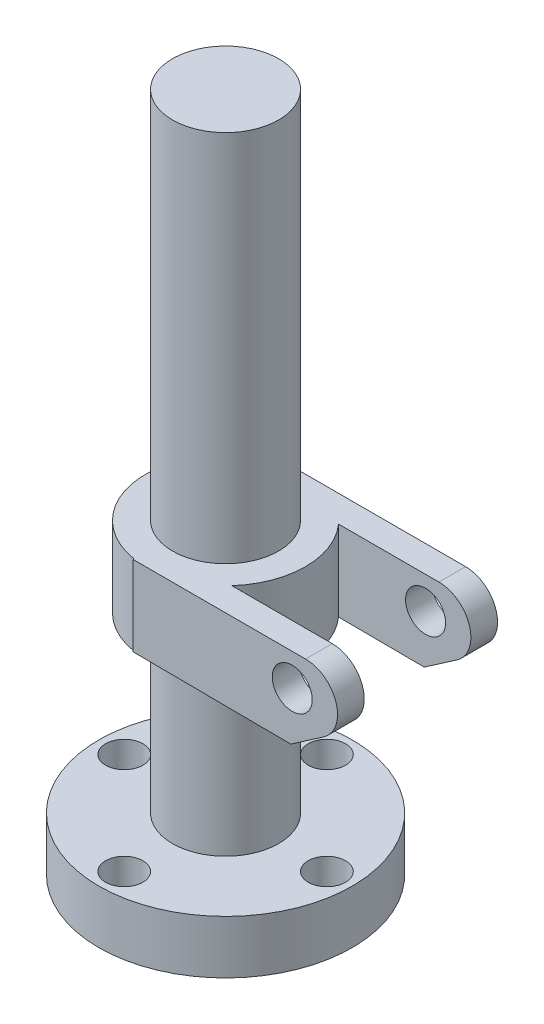
ISO-10303-21;
HEADER;
FILE_DESCRIPTION(('STEP AP214'),'2;1');
FILE_NAME('part.step','',(''),(''),'','','');
FILE_SCHEMA(('AUTOMOTIVE_DESIGN { 1 0 10303 214 1 1 1 1 }'));
ENDSEC;
DATA;
#1=APPLICATION_CONTEXT('core data for automotive mechanical design processes');
#2=APPLICATION_PROTOCOL_DEFINITION('international standard','automotive_design',2000,#1);
#3=PRODUCT_CONTEXT('',#1,'mechanical');
#4=PRODUCT('Part','Part','',(#3));
#5=PRODUCT_RELATED_PRODUCT_CATEGORY('part','',(#4));
#6=PRODUCT_DEFINITION_FORMATION('','',#4);
#7=PRODUCT_DEFINITION_CONTEXT('part definition',#1,'design');
#8=PRODUCT_DEFINITION('design','',#6,#7);
#9=PRODUCT_DEFINITION_SHAPE('','',#8);
#10=(LENGTH_UNIT() NAMED_UNIT(*) SI_UNIT(.MILLI.,.METRE.));
#11=(NAMED_UNIT(*) PLANE_ANGLE_UNIT() SI_UNIT($,.RADIAN.));
#12=(NAMED_UNIT(*) SI_UNIT($,.STERADIAN.) SOLID_ANGLE_UNIT());
#13=UNCERTAINTY_MEASURE_WITH_UNIT(LENGTH_MEASURE(1.E-05),#10,'distance_accuracy_value','');
#14=(GEOMETRIC_REPRESENTATION_CONTEXT(3) GLOBAL_UNCERTAINTY_ASSIGNED_CONTEXT((#13)) GLOBAL_UNIT_ASSIGNED_CONTEXT((#10,
#11,#12)) REPRESENTATION_CONTEXT('',''));
#15=CARTESIAN_POINT('',(0.,0.,0.));
#16=DIRECTION('',(0.,0.,1.));
#17=DIRECTION('',(1.,0.,0.));
#18=AXIS2_PLACEMENT_3D('',#15,#16,#17);
#19=CARTESIAN_POINT('',(0.,115.,0.));
#20=DIRECTION('',(0.,1.,0.));
#21=DIRECTION('',(0.,0.,1.));
#22=AXIS2_PLACEMENT_3D('',#19,#20,#21);
#23=PLANE('',#22);
#24=CARTESIAN_POINT('',(0.,115.,0.));
#25=DIRECTION('',(0.,1.,0.));
#26=DIRECTION('',(0.,0.,1.));
#27=AXIS2_PLACEMENT_3D('',#24,#25,#26);
#28=CIRCLE('',#27,19.9);
#29=CARTESIAN_POINT('',(0.,115.,19.9));
#30=VERTEX_POINT('',#29);
#31=EDGE_CURVE('E261',#30,#30,#28,.T.);
#32=ORIENTED_EDGE('',*,*,#31,.F.);
#33=EDGE_LOOP('',(#32));
#34=FACE_BOUND('',#33,.T.);
#35=DIRECTION('',(-1.,0.,0.));
#36=VECTOR('',#35,1.);
#37=CARTESIAN_POINT('',(22.3606797749979,115.,-20.));
#38=LINE('',#37,#36);
#39=CARTESIAN_POINT('',(60.,115.,-20.));
#40=VERTEX_POINT('',#39);
#41=CARTESIAN_POINT('',(22.3606797749979,115.,-20.));
#42=VERTEX_POINT('',#41);
#43=EDGE_CURVE('E154',#40,#42,#38,.T.);
#44=ORIENTED_EDGE('',*,*,#43,.F.);
#45=DIRECTION('',(0.,0.,1.));
#46=VECTOR('',#45,1.);
#47=CARTESIAN_POINT('',(60.,115.,-30.));
#48=LINE('',#47,#46);
#49=CARTESIAN_POINT('',(60.,115.,-30.));
#50=VERTEX_POINT('',#49);
#51=EDGE_CURVE('E227',#50,#40,#48,.T.);
#52=ORIENTED_EDGE('',*,*,#51,.F.);
#53=DIRECTION('',(-1.,0.,0.));
#54=VECTOR('',#53,1.);
#55=CARTESIAN_POINT('',(-4.68489562855849,115.,-30.));
#56=LINE('',#55,#54);
#57=CARTESIAN_POINT('',(-4.68489562855849,115.,-30.));
#58=VERTEX_POINT('',#57);
#59=EDGE_CURVE('E218',#50,#58,#56,.T.);
#60=ORIENTED_EDGE('',*,*,#59,.T.);
#61=DIRECTION('',(0.,0.,1.));
#62=VECTOR('',#61,1.);
#63=CARTESIAN_POINT('',(-4.68489562855849,115.,-30.));
#64=LINE('',#63,#62);
#65=CARTESIAN_POINT('',(-4.68489562855849,115.,-29.6319380559138));
#66=VERTEX_POINT('',#65);
#67=EDGE_CURVE('E221',#58,#66,#64,.T.);
#68=ORIENTED_EDGE('',*,*,#67,.T.);
#69=CARTESIAN_POINT('',(0.,115.,0.));
#70=DIRECTION('',(0.,1.,0.));
#71=DIRECTION('',(0.,0.,1.));
#72=AXIS2_PLACEMENT_3D('',#69,#70,#71);
#73=CIRCLE('',#72,30.);
#74=CARTESIAN_POINT('',(-4.68489562855849,115.,29.6319380559138));
#75=VERTEX_POINT('',#74);
#76=EDGE_CURVE('E267',#66,#75,#73,.T.);
#77=ORIENTED_EDGE('',*,*,#76,.T.);
#78=CARTESIAN_POINT('',(-4.68489562855849,115.,30.));
#79=VERTEX_POINT('',#78);
#80=EDGE_CURVE('E226',#75,#79,#64,.T.);
#81=ORIENTED_EDGE('',*,*,#80,.T.);
#82=DIRECTION('',(-1.,0.,0.));
#83=VECTOR('',#82,1.);
#84=CARTESIAN_POINT('',(-4.68489562855849,115.,30.));
#85=LINE('',#84,#83);
#86=CARTESIAN_POINT('',(60.,115.,30.));
#87=VERTEX_POINT('',#86);
#88=EDGE_CURVE('E199',#87,#79,#85,.T.);
#89=ORIENTED_EDGE('',*,*,#88,.F.);
#90=CARTESIAN_POINT('',(60.,115.,20.));
#91=VERTEX_POINT('',#90);
#92=EDGE_CURVE('E230',#91,#87,#48,.T.);
#93=ORIENTED_EDGE('',*,*,#92,.F.);
#94=DIRECTION('',(1.,0.,0.));
#95=VECTOR('',#94,1.);
#96=CARTESIAN_POINT('',(85.6131812639909,115.,20.));
#97=LINE('',#96,#95);
#98=CARTESIAN_POINT('',(22.3606797749979,115.,20.));
#99=VERTEX_POINT('',#98);
#100=EDGE_CURVE('E151',#99,#91,#97,.T.);
#101=ORIENTED_EDGE('',*,*,#100,.F.);
#102=CARTESIAN_POINT('',(0.,115.,0.));
#103=DIRECTION('',(0.,-1.,0.));
#104=DIRECTION('',(0.,0.,1.));
#105=AXIS2_PLACEMENT_3D('',#102,#103,#104);
#106=CIRCLE('',#105,30.);
#107=EDGE_CURVE('E144',#42,#99,#106,.T.);
#108=ORIENTED_EDGE('',*,*,#107,.F.);
#109=EDGE_LOOP('',(#44,#52,#60,#68,#77,#81,#89,#93,#101,#108));
#110=FACE_BOUND('',#109,.T.);
#111=ADVANCED_FACE('F43',(#34,#110),#23,.T.);
#112=CARTESIAN_POINT('',(54.4855596327094,84.6062896950359,-30.));
#113=DIRECTION('',(-0.00665368532404855,-0.999977863990803,0.));
#114=DIRECTION('',(0.999977863990803,-0.00665368532404855,0.));
#115=AXIS2_PLACEMENT_3D('',#112,#113,#114);
#116=PLANE('',#115);
#117=DIRECTION('',(0.999977863990803,-0.00665368532404855,0.));
#118=VECTOR('',#117,1.);
#119=CARTESIAN_POINT('',(54.4855596327094,84.6062896950359,-20.));
#120=LINE('',#119,#118);
#121=CARTESIAN_POINT('',(22.3606797749979,84.8200432683331,-20.));
#122=VERTEX_POINT('',#121);
#123=CARTESIAN_POINT('',(54.4855596327094,84.6062896950359,-20.));
#124=VERTEX_POINT('',#123);
#125=EDGE_CURVE('E180',#122,#124,#120,.T.);
#126=ORIENTED_EDGE('',*,*,#125,.F.);
#127=CARTESIAN_POINT('',(0.,84.9688274886766,0.));
#128=DIRECTION('',(-0.00665368532404855,-0.999977863990803,0.));
#129=DIRECTION('',(-0.999977863990803,0.00665368532404855,0.));
#130=AXIS2_PLACEMENT_3D('',#127,#128,#129);
#131=ELLIPSE('',#130,30.0006640949763,30.);
#132=CARTESIAN_POINT('',(22.3606797749979,84.8200432683331,20.));
#133=VERTEX_POINT('',#132);
#134=EDGE_CURVE('E11',#133,#122,#131,.F.);
#135=ORIENTED_EDGE('',*,*,#134,.F.);
#136=DIRECTION('',(-0.999977863990803,0.00665368532404855,0.));
#137=VECTOR('',#136,1.);
#138=CARTESIAN_POINT('',(54.4855596327094,84.6062896950359,20.));
#139=LINE('',#138,#137);
#140=CARTESIAN_POINT('',(54.4855596327094,84.6062896950359,20.));
#141=VERTEX_POINT('',#140);
#142=EDGE_CURVE('E175',#141,#133,#139,.T.);
#143=ORIENTED_EDGE('',*,*,#142,.F.);
#144=DIRECTION('',(0.,0.,1.));
#145=VECTOR('',#144,1.);
#146=CARTESIAN_POINT('',(54.4855596327094,84.6062896950359,-30.));
#147=LINE('',#146,#145);
#148=CARTESIAN_POINT('',(54.4855596327094,84.6062896950359,30.));
#149=VERTEX_POINT('',#148);
#150=EDGE_CURVE('E240',#141,#149,#147,.T.);
#151=ORIENTED_EDGE('',*,*,#150,.T.);
#152=DIRECTION('',(0.999977863990803,-0.00665368532404855,0.));
#153=VECTOR('',#152,1.);
#154=CARTESIAN_POINT('',(54.4855596327094,84.6062896950359,30.));
#155=LINE('',#154,#153);
#156=CARTESIAN_POINT('',(-4.68489562855849,85.,30.));
#157=VERTEX_POINT('',#156);
#158=EDGE_CURVE('E187',#157,#149,#155,.T.);
#159=ORIENTED_EDGE('',*,*,#158,.F.);
#160=DIRECTION('',(0.,0.,1.));
#161=VECTOR('',#160,1.);
#162=CARTESIAN_POINT('',(-4.68489562855849,85.,-30.));
#163=LINE('',#162,#161);
#164=CARTESIAN_POINT('',(-4.68489562855848,85.,29.6319380559138));
#165=VERTEX_POINT('',#164);
#166=EDGE_CURVE('E68',#165,#157,#163,.T.);
#167=ORIENTED_EDGE('',*,*,#166,.F.);
#168=DIRECTION('',(0.,0.,1.));
#169=VECTOR('',#168,1.);
#170=CARTESIAN_POINT('',(-4.68489562855849,85.,0.));
#171=LINE('',#170,#169);
#172=CARTESIAN_POINT('',(-4.68489562855849,85.,19.3406761244149));
#173=VERTEX_POINT('',#172);
#174=EDGE_CURVE('E265',#173,#165,#171,.T.);
#175=ORIENTED_EDGE('',*,*,#174,.F.);
#176=CARTESIAN_POINT('',(0.,84.9688274886766,0.));
#177=DIRECTION('',(-0.00665368532404855,-0.999977863990803,0.));
#178=DIRECTION('',(0.999977863990803,-0.00665368532404855,0.));
#179=AXIS2_PLACEMENT_3D('',#176,#177,#178);
#180=ELLIPSE('',#179,19.9004405163343,19.9);
#181=CARTESIAN_POINT('',(-4.68489562855849,85.,-19.3406761244149));
#182=VERTEX_POINT('',#181);
#183=EDGE_CURVE('E225',#182,#173,#180,.T.);
#184=ORIENTED_EDGE('',*,*,#183,.F.);
#185=CARTESIAN_POINT('',(-4.68489562855849,85.,-29.6319380559138));
#186=VERTEX_POINT('',#185);
#187=EDGE_CURVE('E292',#186,#182,#171,.T.);
#188=ORIENTED_EDGE('',*,*,#187,.F.);
#189=CARTESIAN_POINT('',(-4.68489562855849,85.,-30.));
#190=VERTEX_POINT('',#189);
#191=EDGE_CURVE('E241',#190,#186,#163,.T.);
#192=ORIENTED_EDGE('',*,*,#191,.F.);
#193=DIRECTION('',(0.999977863990803,-0.00665368532404855,0.));
#194=VECTOR('',#193,1.);
#195=CARTESIAN_POINT('',(54.4855596327094,84.6062896950359,-30.));
#196=LINE('',#195,#194);
#197=CARTESIAN_POINT('',(54.4855596327094,84.6062896950359,-30.));
#198=VERTEX_POINT('',#197);
#199=EDGE_CURVE('E206',#190,#198,#196,.T.);
#200=ORIENTED_EDGE('',*,*,#199,.T.);
#201=EDGE_CURVE('E236',#198,#124,#147,.T.);
#202=ORIENTED_EDGE('',*,*,#201,.T.);
#203=EDGE_LOOP('',(#126,#135,#143,#151,#159,#167,#175,#184,#188,#192,#200,#202));
#204=FACE_BOUND('',#203,.T.);
#205=ADVANCED_FACE('F308',(#204),#116,.T.);
#206=CARTESIAN_POINT('',(60.,103.,-30.));
#207=DIRECTION('',(0.,0.,1.));
#208=DIRECTION('',(1.,0.,0.));
#209=AXIS2_PLACEMENT_3D('',#206,#207,#208);
#210=CYLINDRICAL_SURFACE('',#209,12.);
#211=CARTESIAN_POINT('',(60.,103.,-20.));
#212=DIRECTION('',(0.,0.,-1.));
#213=DIRECTION('',(-1.,0.,0.));
#214=AXIS2_PLACEMENT_3D('',#211,#212,#213);
#215=CIRCLE('',#214,12.);
#216=CARTESIAN_POINT('',(66.8201813211914,93.126544336147,-20.));
#217=VERTEX_POINT('',#216);
#218=EDGE_CURVE('E157',#217,#40,#215,.F.);
#219=ORIENTED_EDGE('',*,*,#218,.F.);
#220=DIRECTION('',(0.,0.,1.));
#221=VECTOR('',#220,1.);
#222=CARTESIAN_POINT('',(66.8201813211914,93.126544336147,-30.));
#223=LINE('',#222,#221);
#224=CARTESIAN_POINT('',(66.8201813211914,93.126544336147,-30.));
#225=VERTEX_POINT('',#224);
#226=EDGE_CURVE('E231',#225,#217,#223,.T.);
#227=ORIENTED_EDGE('',*,*,#226,.F.);
#228=CARTESIAN_POINT('',(60.,103.,-30.));
#229=DIRECTION('',(0.,0.,1.));
#230=DIRECTION('',(1.,0.,0.));
#231=AXIS2_PLACEMENT_3D('',#228,#229,#230);
#232=CIRCLE('',#231,12.);
#233=EDGE_CURVE('E214',#225,#50,#232,.T.);
#234=ORIENTED_EDGE('',*,*,#233,.T.);
#235=ORIENTED_EDGE('',*,*,#51,.T.);
#236=EDGE_LOOP('',(#219,#227,#234,#235));
#237=FACE_BOUND('',#236,.T.);
#238=ADVANCED_FACE('F300',(#237),#210,.T.);
#239=CARTESIAN_POINT('',(66.8201813211914,93.126544336147,-30.));
#240=DIRECTION('',(0.56834844343262,-0.822787971987752,0.));
#241=DIRECTION('',(0.822787971987752,0.56834844343262,0.));
#242=AXIS2_PLACEMENT_3D('',#239,#240,#241);
#243=PLANE('',#242);
#244=DIRECTION('',(0.822787971987752,0.56834844343262,0.));
#245=VECTOR('',#244,1.);
#246=CARTESIAN_POINT('',(66.8201813211914,93.126544336147,-20.));
#247=LINE('',#246,#245);
#248=EDGE_CURVE('E53',#124,#217,#247,.T.);
#249=ORIENTED_EDGE('',*,*,#248,.F.);
#250=ORIENTED_EDGE('',*,*,#201,.F.);
#251=DIRECTION('',(0.822787971987752,0.56834844343262,0.));
#252=VECTOR('',#251,1.);
#253=CARTESIAN_POINT('',(66.8201813211914,93.126544336147,-30.));
#254=LINE('',#253,#252);
#255=EDGE_CURVE('E210',#198,#225,#254,.T.);
#256=ORIENTED_EDGE('',*,*,#255,.T.);
#257=ORIENTED_EDGE('',*,*,#226,.T.);
#258=EDGE_LOOP('',(#249,#250,#256,#257));
#259=FACE_BOUND('',#258,.T.);
#260=ADVANCED_FACE('F302',(#259),#243,.T.);
#261=CARTESIAN_POINT('',(0.,20.,0.));
#262=DIRECTION('',(0.,-1.,0.));
#263=DIRECTION('',(0.,0.,-1.));
#264=AXIS2_PLACEMENT_3D('',#261,#262,#263);
#265=CYLINDRICAL_SURFACE('',#264,47.5);
#266=CARTESIAN_POINT('',(0.,20.,0.));
#267=DIRECTION('',(0.,1.,0.));
#268=DIRECTION('',(0.,0.,1.));
#269=AXIS2_PLACEMENT_3D('',#266,#267,#268);
#270=CIRCLE('',#269,47.5);
#271=CARTESIAN_POINT('',(0.,20.,47.5));
#272=VERTEX_POINT('',#271);
#273=EDGE_CURVE('E282',#272,#272,#270,.T.);
#274=ORIENTED_EDGE('',*,*,#273,.F.);
#275=EDGE_LOOP('',(#274));
#276=FACE_BOUND('',#275,.T.);
#277=CARTESIAN_POINT('',(0.,0.,0.));
#278=DIRECTION('',(0.,1.,0.));
#279=DIRECTION('',(0.,0.,1.));
#280=AXIS2_PLACEMENT_3D('',#277,#278,#279);
#281=CIRCLE('',#280,47.5);
#282=CARTESIAN_POINT('',(0.,0.,47.5));
#283=VERTEX_POINT('',#282);
#284=EDGE_CURVE('E278',#283,#283,#281,.T.);
#285=ORIENTED_EDGE('',*,*,#284,.T.);
#286=EDGE_LOOP('',(#285));
#287=FACE_BOUND('',#286,.T.);
#288=ADVANCED_FACE('F45',(#276,#287),#265,.T.);
#289=CARTESIAN_POINT('',(0.,20.,0.));
#290=DIRECTION('',(0.,1.,0.));
#291=DIRECTION('',(0.,0.,1.));
#292=AXIS2_PLACEMENT_3D('',#289,#290,#291);
#293=PLANE('',#292);
#294=CARTESIAN_POINT('',(38.,20.,-3.98028872628117E-13));
#295=DIRECTION('',(0.,1.,0.));
#296=DIRECTION('',(0.,0.,1.));
#297=AXIS2_PLACEMENT_3D('',#294,#295,#296);
#298=CIRCLE('',#297,7.);
#299=CARTESIAN_POINT('',(38.,20.,6.9999999999996));
#300=VERTEX_POINT('',#299);
#301=EDGE_CURVE('E760',#300,#300,#298,.T.);
#302=ORIENTED_EDGE('',*,*,#301,.F.);
#303=EDGE_LOOP('',(#302));
#304=FACE_BOUND('',#303,.T.);
#305=CARTESIAN_POINT('',(0.,20.,38.));
#306=DIRECTION('',(0.,1.,0.));
#307=DIRECTION('',(0.,0.,1.));
#308=AXIS2_PLACEMENT_3D('',#305,#306,#307);
#309=CIRCLE('',#308,7.);
#310=CARTESIAN_POINT('',(0.,20.,45.));
#311=VERTEX_POINT('',#310);
#312=EDGE_CURVE('E773',#311,#311,#309,.T.);
#313=ORIENTED_EDGE('',*,*,#312,.F.);
#314=EDGE_LOOP('',(#313));
#315=FACE_BOUND('',#314,.T.);
#316=CARTESIAN_POINT('',(-38.,20.,1.32676290876039E-13));
#317=DIRECTION('',(0.,1.,0.));
#318=DIRECTION('',(0.,0.,1.));
#319=AXIS2_PLACEMENT_3D('',#316,#317,#318);
#320=CIRCLE('',#319,7.);
#321=CARTESIAN_POINT('',(-38.,20.,7.00000000000013));
#322=VERTEX_POINT('',#321);
#323=EDGE_CURVE('E789',#322,#322,#320,.T.);
#324=ORIENTED_EDGE('',*,*,#323,.F.);
#325=EDGE_LOOP('',(#324));
#326=FACE_BOUND('',#325,.T.);
#327=CARTESIAN_POINT('',(0.,20.,-38.));
#328=DIRECTION('',(0.,1.,0.));
#329=DIRECTION('',(0.,0.,1.));
#330=AXIS2_PLACEMENT_3D('',#327,#328,#329);
#331=CIRCLE('',#330,7.);
#332=CARTESIAN_POINT('',(0.,20.,-31.));
#333=VERTEX_POINT('',#332);
#334=EDGE_CURVE('E805',#333,#333,#331,.T.);
#335=ORIENTED_EDGE('',*,*,#334,.F.);
#336=EDGE_LOOP('',(#335));
#337=FACE_BOUND('',#336,.T.);
#338=CARTESIAN_POINT('',(0.,20.,0.));
#339=DIRECTION('',(0.,1.,0.));
#340=DIRECTION('',(0.,0.,1.));
#341=AXIS2_PLACEMENT_3D('',#338,#339,#340);
#342=CIRCLE('',#341,19.9);
#343=CARTESIAN_POINT('',(0.,20.,19.9));
#344=VERTEX_POINT('',#343);
#345=EDGE_CURVE('E266',#344,#344,#342,.T.);
#346=ORIENTED_EDGE('',*,*,#345,.F.);
#347=EDGE_LOOP('',(#346));
#348=FACE_BOUND('',#347,.T.);
#349=ORIENTED_EDGE('',*,*,#273,.T.);
#350=EDGE_LOOP('',(#349));
#351=FACE_BOUND('',#350,.T.);
#352=ADVANCED_FACE('F328',(#304,#315,#326,#337,#348,#351),#293,.T.);
#353=CARTESIAN_POINT('',(0.,0.,0.));
#354=DIRECTION('',(0.,1.,0.));
#355=DIRECTION('',(0.,0.,1.));
#356=AXIS2_PLACEMENT_3D('',#353,#354,#355);
#357=PLANE('',#356);
#358=CARTESIAN_POINT('',(38.,0.,-3.98028872628117E-13));
#359=DIRECTION('',(0.,1.,0.));
#360=DIRECTION('',(0.,0.,1.));
#361=AXIS2_PLACEMENT_3D('',#358,#359,#360);
#362=CIRCLE('',#361,5.);
#363=CARTESIAN_POINT('',(38.,0.,4.9999999999996));
#364=VERTEX_POINT('',#363);
#365=EDGE_CURVE('E770',#364,#364,#362,.T.);
#366=ORIENTED_EDGE('',*,*,#365,.T.);
#367=EDGE_LOOP('',(#366));
#368=FACE_BOUND('',#367,.T.);
#369=CARTESIAN_POINT('',(0.,0.,38.));
#370=DIRECTION('',(0.,1.,0.));
#371=DIRECTION('',(0.,0.,1.));
#372=AXIS2_PLACEMENT_3D('',#369,#370,#371);
#373=CIRCLE('',#372,4.99999999999999);
#374=CARTESIAN_POINT('',(0.,0.,43.));
#375=VERTEX_POINT('',#374);
#376=EDGE_CURVE('E785',#375,#375,#373,.T.);
#377=ORIENTED_EDGE('',*,*,#376,.T.);
#378=EDGE_LOOP('',(#377));
#379=FACE_BOUND('',#378,.T.);
#380=CARTESIAN_POINT('',(-38.,0.,1.32676290876039E-13));
#381=DIRECTION('',(0.,1.,0.));
#382=DIRECTION('',(0.,0.,1.));
#383=AXIS2_PLACEMENT_3D('',#380,#381,#382);
#384=CIRCLE('',#383,5.);
#385=CARTESIAN_POINT('',(-38.,0.,5.00000000000013));
#386=VERTEX_POINT('',#385);
#387=EDGE_CURVE('E801',#386,#386,#384,.T.);
#388=ORIENTED_EDGE('',*,*,#387,.T.);
#389=EDGE_LOOP('',(#388));
#390=FACE_BOUND('',#389,.T.);
#391=CARTESIAN_POINT('',(0.,0.,-38.));
#392=DIRECTION('',(0.,1.,0.));
#393=DIRECTION('',(0.,0.,1.));
#394=AXIS2_PLACEMENT_3D('',#391,#392,#393);
#395=CIRCLE('',#394,4.99999999999999);
#396=CARTESIAN_POINT('',(0.,0.,-33.));
#397=VERTEX_POINT('',#396);
#398=EDGE_CURVE('E817',#397,#397,#395,.T.);
#399=ORIENTED_EDGE('',*,*,#398,.T.);
#400=EDGE_LOOP('',(#399));
#401=FACE_BOUND('',#400,.T.);
#402=CARTESIAN_POINT('',(0.,0.,0.));
#403=DIRECTION('',(0.,-1.,0.));
#404=DIRECTION('',(0.,0.,-1.));
#405=AXIS2_PLACEMENT_3D('',#402,#403,#404);
#406=CIRCLE('',#405,20.);
#407=CARTESIAN_POINT('',(0.,0.,-20.));
#408=VERTEX_POINT('',#407);
#409=EDGE_CURVE('E821',#408,#408,#406,.T.);
#410=ORIENTED_EDGE('',*,*,#409,.F.);
#411=EDGE_LOOP('',(#410));
#412=FACE_BOUND('',#411,.T.);
#413=ORIENTED_EDGE('',*,*,#284,.F.);
#414=EDGE_LOOP('',(#413));
#415=FACE_BOUND('',#414,.T.);
#416=ADVANCED_FACE('F324',(#368,#379,#390,#401,#412,#415),#357,.F.);
#417=CARTESIAN_POINT('',(0.,85.,0.));
#418=DIRECTION('',(0.,-1.,0.));
#419=DIRECTION('',(0.,0.,-1.));
#420=AXIS2_PLACEMENT_3D('',#417,#418,#419);
#421=CYLINDRICAL_SURFACE('',#420,19.9);
#422=CARTESIAN_POINT('',(0.,85.,0.));
#423=DIRECTION('',(0.,1.,0.));
#424=DIRECTION('',(0.,0.,1.));
#425=AXIS2_PLACEMENT_3D('',#422,#423,#424);
#426=CIRCLE('',#425,19.9);
#427=EDGE_CURVE('E271',#182,#173,#426,.T.);
#428=ORIENTED_EDGE('',*,*,#427,.F.);
#429=ORIENTED_EDGE('',*,*,#183,.T.);
#430=EDGE_LOOP('',(#428,#429));
#431=FACE_BOUND('',#430,.T.);
#432=ORIENTED_EDGE('',*,*,#345,.T.);
#433=EDGE_LOOP('',(#432));
#434=FACE_BOUND('',#433,.T.);
#435=ADVANCED_FACE('F321',(#431,#434),#421,.T.);
#436=CARTESIAN_POINT('',(0.,115.,0.));
#437=DIRECTION('',(0.,-1.,0.));
#438=DIRECTION('',(0.,0.,-1.));
#439=AXIS2_PLACEMENT_3D('',#436,#437,#438);
#440=CYLINDRICAL_SURFACE('',#439,30.);
#441=ORIENTED_EDGE('',*,*,#76,.F.);
#442=DIRECTION('',(0.,-1.,0.));
#443=VECTOR('',#442,1.);
#444=CARTESIAN_POINT('',(-4.68489562855849,115.,-29.6319380559138));
#445=LINE('',#444,#443);
#446=EDGE_CURVE('E252',#66,#186,#445,.T.);
#447=ORIENTED_EDGE('',*,*,#446,.T.);
#448=CARTESIAN_POINT('',(0.,85.,0.));
#449=DIRECTION('',(0.,1.,0.));
#450=DIRECTION('',(0.,0.,1.));
#451=AXIS2_PLACEMENT_3D('',#448,#449,#450);
#452=CIRCLE('',#451,30.);
#453=EDGE_CURVE('E260',#186,#165,#452,.T.);
#454=ORIENTED_EDGE('',*,*,#453,.T.);
#455=DIRECTION('',(0.,-1.,0.));
#456=VECTOR('',#455,1.);
#457=CARTESIAN_POINT('',(-4.68489562855849,115.,29.6319380559138));
#458=LINE('',#457,#456);
#459=EDGE_CURVE('E248',#165,#75,#458,.F.);
#460=ORIENTED_EDGE('',*,*,#459,.T.);
#461=EDGE_LOOP('',(#441,#447,#454,#460));
#462=FACE_BOUND('',#461,.T.);
#463=ADVANCED_FACE('F316',(#462),#440,.T.);
#464=CARTESIAN_POINT('',(0.,85.,0.));
#465=DIRECTION('',(0.,1.,0.));
#466=DIRECTION('',(0.,0.,1.));
#467=AXIS2_PLACEMENT_3D('',#464,#465,#466);
#468=PLANE('',#467);
#469=ORIENTED_EDGE('',*,*,#453,.F.);
#470=ORIENTED_EDGE('',*,*,#187,.T.);
#471=ORIENTED_EDGE('',*,*,#427,.T.);
#472=ORIENTED_EDGE('',*,*,#174,.T.);
#473=EDGE_LOOP('',(#469,#470,#471,#472));
#474=FACE_BOUND('',#473,.T.);
#475=ADVANCED_FACE('F318',(#474),#468,.F.);
#476=CARTESIAN_POINT('',(0.,255.,0.));
#477=DIRECTION('',(0.,-1.,0.));
#478=DIRECTION('',(0.,0.,-1.));
#479=AXIS2_PLACEMENT_3D('',#476,#477,#478);
#480=CYLINDRICAL_SURFACE('',#479,19.9);
#481=CARTESIAN_POINT('',(0.,255.,0.));
#482=DIRECTION('',(0.,1.,0.));
#483=DIRECTION('',(0.,0.,1.));
#484=AXIS2_PLACEMENT_3D('',#481,#482,#483);
#485=CIRCLE('',#484,19.9);
#486=CARTESIAN_POINT('',(0.,255.,19.9));
#487=VERTEX_POINT('',#486);
#488=EDGE_CURVE('E256',#487,#487,#485,.T.);
#489=ORIENTED_EDGE('',*,*,#488,.F.);
#490=EDGE_LOOP('',(#489));
#491=FACE_BOUND('',#490,.T.);
#492=ORIENTED_EDGE('',*,*,#31,.T.);
#493=EDGE_LOOP('',(#492));
#494=FACE_BOUND('',#493,.T.);
#495=ADVANCED_FACE('F355',(#491,#494),#480,.T.);
#496=CARTESIAN_POINT('',(0.,255.,0.));
#497=DIRECTION('',(0.,1.,0.));
#498=DIRECTION('',(0.,0.,1.));
#499=AXIS2_PLACEMENT_3D('',#496,#497,#498);
#500=PLANE('',#499);
#501=ORIENTED_EDGE('',*,*,#488,.T.);
#502=EDGE_LOOP('',(#501));
#503=FACE_BOUND('',#502,.T.);
#504=ADVANCED_FACE('F374',(#503),#500,.T.);
#505=CARTESIAN_POINT('',(-4.68489562855849,85.,-30.));
#506=DIRECTION('',(-1.,0.,0.));
#507=DIRECTION('',(0.,0.,1.));
#508=AXIS2_PLACEMENT_3D('',#505,#506,#507);
#509=PLANE('',#508);
#510=ORIENTED_EDGE('',*,*,#446,.F.);
#511=ORIENTED_EDGE('',*,*,#67,.F.);
#512=DIRECTION('',(0.,-1.,0.));
#513=VECTOR('',#512,1.);
#514=CARTESIAN_POINT('',(-4.68489562855849,85.,-30.));
#515=LINE('',#514,#513);
#516=EDGE_CURVE('E202',#58,#190,#515,.T.);
#517=ORIENTED_EDGE('',*,*,#516,.T.);
#518=ORIENTED_EDGE('',*,*,#191,.T.);
#519=EDGE_LOOP('',(#510,#511,#517,#518));
#520=FACE_BOUND('',#519,.T.);
#521=ADVANCED_FACE('F311',(#520),#509,.T.);
#522=ORIENTED_EDGE('',*,*,#459,.F.);
#523=ORIENTED_EDGE('',*,*,#166,.T.);
#524=DIRECTION('',(0.,-1.,0.));
#525=VECTOR('',#524,1.);
#526=CARTESIAN_POINT('',(-4.68489562855849,85.,30.));
#527=LINE('',#526,#525);
#528=EDGE_CURVE('E183',#79,#157,#527,.T.);
#529=ORIENTED_EDGE('',*,*,#528,.F.);
#530=ORIENTED_EDGE('',*,*,#80,.F.);
#531=EDGE_LOOP('',(#522,#523,#529,#530));
#532=FACE_BOUND('',#531,.T.);
#533=ADVANCED_FACE('F388',(#532),#509,.T.);
#534=CARTESIAN_POINT('',(60.,103.,20.));
#535=DIRECTION('',(0.,0.,1.));
#536=DIRECTION('',(1.,0.,0.));
#537=AXIS2_PLACEMENT_3D('',#534,#535,#536);
#538=CIRCLE('',#537,12.);
#539=CARTESIAN_POINT('',(66.8201813211914,93.126544336147,20.));
#540=VERTEX_POINT('',#539);
#541=EDGE_CURVE('E60',#91,#540,#538,.F.);
#542=ORIENTED_EDGE('',*,*,#541,.F.);
#543=ORIENTED_EDGE('',*,*,#92,.T.);
#544=CARTESIAN_POINT('',(60.,103.,30.));
#545=DIRECTION('',(0.,0.,1.));
#546=DIRECTION('',(1.,0.,0.));
#547=AXIS2_PLACEMENT_3D('',#544,#545,#546);
#548=CIRCLE('',#547,12.);
#549=CARTESIAN_POINT('',(66.8201813211914,93.126544336147,30.));
#550=VERTEX_POINT('',#549);
#551=EDGE_CURVE('E195',#550,#87,#548,.T.);
#552=ORIENTED_EDGE('',*,*,#551,.F.);
#553=EDGE_CURVE('E235',#540,#550,#223,.T.);
#554=ORIENTED_EDGE('',*,*,#553,.F.);
#555=EDGE_LOOP('',(#542,#543,#552,#554));
#556=FACE_BOUND('',#555,.T.);
#557=ADVANCED_FACE('F395',(#556),#210,.T.);
#558=DIRECTION('',(-0.822787971987752,-0.56834844343262,0.));
#559=VECTOR('',#558,1.);
#560=CARTESIAN_POINT('',(66.8201813211914,93.126544336147,20.));
#561=LINE('',#560,#559);
#562=EDGE_CURVE('E293',#540,#141,#561,.T.);
#563=ORIENTED_EDGE('',*,*,#562,.F.);
#564=ORIENTED_EDGE('',*,*,#553,.T.);
#565=DIRECTION('',(0.822787971987752,0.56834844343262,0.));
#566=VECTOR('',#565,1.);
#567=CARTESIAN_POINT('',(66.8201813211914,93.126544336147,30.));
#568=LINE('',#567,#566);
#569=EDGE_CURVE('E191',#149,#550,#568,.T.);
#570=ORIENTED_EDGE('',*,*,#569,.F.);
#571=ORIENTED_EDGE('',*,*,#150,.F.);
#572=EDGE_LOOP('',(#563,#564,#570,#571));
#573=FACE_BOUND('',#572,.T.);
#574=ADVANCED_FACE('F402',(#573),#243,.T.);
#575=CARTESIAN_POINT('',(60.,103.,-30.));
#576=DIRECTION('',(0.,0.,1.));
#577=DIRECTION('',(1.,0.,0.));
#578=AXIS2_PLACEMENT_3D('',#575,#576,#577);
#579=PLANE('',#578);
#580=CARTESIAN_POINT('',(55.,103.,-30.));
#581=DIRECTION('',(0.,0.,1.));
#582=DIRECTION('',(1.,0.,0.));
#583=AXIS2_PLACEMENT_3D('',#580,#581,#582);
#584=CIRCLE('',#583,7.5);
#585=CARTESIAN_POINT('',(62.5,103.,-30.));
#586=VERTEX_POINT('',#585);
#587=EDGE_CURVE('E162',#586,#586,#584,.T.);
#588=ORIENTED_EDGE('',*,*,#587,.T.);
#589=EDGE_LOOP('',(#588));
#590=FACE_BOUND('',#589,.T.);
#591=ORIENTED_EDGE('',*,*,#516,.F.);
#592=ORIENTED_EDGE('',*,*,#59,.F.);
#593=ORIENTED_EDGE('',*,*,#233,.F.);
#594=ORIENTED_EDGE('',*,*,#255,.F.);
#595=ORIENTED_EDGE('',*,*,#199,.F.);
#596=EDGE_LOOP('',(#591,#592,#593,#594,#595));
#597=FACE_BOUND('',#596,.T.);
#598=ADVANCED_FACE('F307',(#590,#597),#579,.F.);
#599=CARTESIAN_POINT('',(60.,103.,30.));
#600=DIRECTION('',(0.,0.,1.));
#601=DIRECTION('',(1.,0.,0.));
#602=AXIS2_PLACEMENT_3D('',#599,#600,#601);
#603=PLANE('',#602);
#604=CARTESIAN_POINT('',(55.,103.,30.));
#605=DIRECTION('',(0.,0.,1.));
#606=DIRECTION('',(1.,0.,0.));
#607=AXIS2_PLACEMENT_3D('',#604,#605,#606);
#608=CIRCLE('',#607,7.5);
#609=CARTESIAN_POINT('',(62.5,103.,30.));
#610=VERTEX_POINT('',#609);
#611=EDGE_CURVE('E826',#610,#610,#608,.T.);
#612=ORIENTED_EDGE('',*,*,#611,.F.);
#613=EDGE_LOOP('',(#612));
#614=FACE_BOUND('',#613,.T.);
#615=ORIENTED_EDGE('',*,*,#528,.T.);
#616=ORIENTED_EDGE('',*,*,#158,.T.);
#617=ORIENTED_EDGE('',*,*,#569,.T.);
#618=ORIENTED_EDGE('',*,*,#551,.T.);
#619=ORIENTED_EDGE('',*,*,#88,.T.);
#620=EDGE_LOOP('',(#615,#616,#617,#618,#619));
#621=FACE_BOUND('',#620,.T.);
#622=ADVANCED_FACE('F419',(#614,#621),#603,.T.);
#623=CARTESIAN_POINT('',(22.3606797749979,75.,-20.));
#624=DIRECTION('',(0.,0.,-1.));
#625=DIRECTION('',(-1.,0.,0.));
#626=AXIS2_PLACEMENT_3D('',#623,#624,#625);
#627=PLANE('',#626);
#628=CARTESIAN_POINT('',(55.,103.,-20.));
#629=DIRECTION('',(0.,0.,-1.));
#630=DIRECTION('',(-1.,0.,0.));
#631=AXIS2_PLACEMENT_3D('',#628,#629,#630);
#632=CIRCLE('',#631,7.5);
#633=CARTESIAN_POINT('',(47.5,103.,-20.));
#634=VERTEX_POINT('',#633);
#635=EDGE_CURVE('E833',#634,#634,#632,.T.);
#636=ORIENTED_EDGE('',*,*,#635,.T.);
#637=EDGE_LOOP('',(#636));
#638=FACE_BOUND('',#637,.T.);
#639=ORIENTED_EDGE('',*,*,#125,.T.);
#640=ORIENTED_EDGE('',*,*,#248,.T.);
#641=ORIENTED_EDGE('',*,*,#218,.T.);
#642=ORIENTED_EDGE('',*,*,#43,.T.);
#643=DIRECTION('',(0.,1.,0.));
#644=VECTOR('',#643,1.);
#645=CARTESIAN_POINT('',(22.3606797749979,75.,-20.));
#646=LINE('',#645,#644);
#647=EDGE_CURVE('E139',#122,#42,#646,.T.);
#648=ORIENTED_EDGE('',*,*,#647,.F.);
#649=EDGE_LOOP('',(#639,#640,#641,#642,#648));
#650=FACE_BOUND('',#649,.T.);
#651=ADVANCED_FACE('F155',(#638,#650),#627,.F.);
#652=CARTESIAN_POINT('',(85.6131812639909,75.,20.));
#653=DIRECTION('',(0.,0.,1.));
#654=DIRECTION('',(1.,0.,0.));
#655=AXIS2_PLACEMENT_3D('',#652,#653,#654);
#656=PLANE('',#655);
#657=CARTESIAN_POINT('',(55.,103.,20.));
#658=DIRECTION('',(0.,0.,1.));
#659=DIRECTION('',(1.,0.,0.));
#660=AXIS2_PLACEMENT_3D('',#657,#658,#659);
#661=CIRCLE('',#660,7.5);
#662=CARTESIAN_POINT('',(62.5,103.,20.));
#663=VERTEX_POINT('',#662);
#664=EDGE_CURVE('E47',#663,#663,#661,.T.);
#665=ORIENTED_EDGE('',*,*,#664,.T.);
#666=EDGE_LOOP('',(#665));
#667=FACE_BOUND('',#666,.T.);
#668=ORIENTED_EDGE('',*,*,#142,.T.);
#669=DIRECTION('',(0.,1.,0.));
#670=VECTOR('',#669,1.);
#671=CARTESIAN_POINT('',(22.3606797749979,75.,20.));
#672=LINE('',#671,#670);
#673=EDGE_CURVE('E150',#133,#99,#672,.T.);
#674=ORIENTED_EDGE('',*,*,#673,.T.);
#675=ORIENTED_EDGE('',*,*,#100,.T.);
#676=ORIENTED_EDGE('',*,*,#541,.T.);
#677=ORIENTED_EDGE('',*,*,#562,.T.);
#678=EDGE_LOOP('',(#668,#674,#675,#676,#677));
#679=FACE_BOUND('',#678,.T.);
#680=ADVANCED_FACE('F434',(#667,#679),#656,.F.);
#681=CARTESIAN_POINT('',(0.,75.,0.));
#682=DIRECTION('',(0.,1.,0.));
#683=DIRECTION('',(0.,0.,1.));
#684=AXIS2_PLACEMENT_3D('',#681,#682,#683);
#685=CYLINDRICAL_SURFACE('',#684,30.);
#686=ORIENTED_EDGE('',*,*,#134,.T.);
#687=ORIENTED_EDGE('',*,*,#647,.T.);
#688=ORIENTED_EDGE('',*,*,#107,.T.);
#689=ORIENTED_EDGE('',*,*,#673,.F.);
#690=EDGE_LOOP('',(#686,#687,#688,#689));
#691=FACE_BOUND('',#690,.T.);
#692=ADVANCED_FACE('F141',(#691),#685,.T.);
#693=CARTESIAN_POINT('',(55.,103.,-47.5));
#694=DIRECTION('',(0.,0.,1.));
#695=DIRECTION('',(1.,0.,0.));
#696=AXIS2_PLACEMENT_3D('',#693,#694,#695);
#697=CYLINDRICAL_SURFACE('',#696,7.5);
#698=ORIENTED_EDGE('',*,*,#611,.T.);
#699=EDGE_LOOP('',(#698));
#700=FACE_BOUND('',#699,.T.);
#701=ORIENTED_EDGE('',*,*,#664,.F.);
#702=EDGE_LOOP('',(#701));
#703=FACE_BOUND('',#702,.T.);
#704=ADVANCED_FACE('F449',(#700,#703),#697,.F.);
#705=ORIENTED_EDGE('',*,*,#635,.F.);
#706=EDGE_LOOP('',(#705));
#707=FACE_BOUND('',#706,.T.);
#708=ORIENTED_EDGE('',*,*,#587,.F.);
#709=EDGE_LOOP('',(#708));
#710=FACE_BOUND('',#709,.T.);
#711=ADVANCED_FACE('F455',(#707,#710),#697,.F.);
#712=CARTESIAN_POINT('',(0.,15.,0.));
#713=DIRECTION('',(0.,-1.,0.));
#714=DIRECTION('',(0.,0.,-1.));
#715=AXIS2_PLACEMENT_3D('',#712,#713,#714);
#716=CYLINDRICAL_SURFACE('',#715,20.);
#717=CARTESIAN_POINT('',(0.,15.,0.));
#718=DIRECTION('',(0.,-1.,0.));
#719=DIRECTION('',(0.,0.,-1.));
#720=AXIS2_PLACEMENT_3D('',#717,#718,#719);
#721=CIRCLE('',#720,20.);
#722=CARTESIAN_POINT('',(0.,15.,-20.));
#723=VERTEX_POINT('',#722);
#724=EDGE_CURVE('E822',#723,#723,#721,.T.);
#725=ORIENTED_EDGE('',*,*,#724,.F.);
#726=EDGE_LOOP('',(#725));
#727=FACE_BOUND('',#726,.T.);
#728=ORIENTED_EDGE('',*,*,#409,.T.);
#729=EDGE_LOOP('',(#728));
#730=FACE_BOUND('',#729,.T.);
#731=ADVANCED_FACE('F463',(#727,#730),#716,.F.);
#732=CARTESIAN_POINT('',(0.,15.,0.));
#733=DIRECTION('',(0.,-1.,0.));
#734=DIRECTION('',(0.,0.,-1.));
#735=AXIS2_PLACEMENT_3D('',#732,#733,#734);
#736=PLANE('',#735);
#737=ORIENTED_EDGE('',*,*,#724,.T.);
#738=EDGE_LOOP('',(#737));
#739=FACE_BOUND('',#738,.T.);
#740=ADVANCED_FACE('F470',(#739),#736,.T.);
#741=CARTESIAN_POINT('',(0.,20.,-38.));
#742=DIRECTION('',(0.,1.,0.));
#743=DIRECTION('',(0.,0.,1.));
#744=AXIS2_PLACEMENT_3D('',#741,#742,#743);
#745=CYLINDRICAL_SURFACE('',#744,5.);
#746=ORIENTED_EDGE('',*,*,#398,.F.);
#747=EDGE_LOOP('',(#746));
#748=FACE_BOUND('',#747,.T.);
#749=CARTESIAN_POINT('',(0.,10.,-38.));
#750=DIRECTION('',(0.,1.,0.));
#751=DIRECTION('',(0.,0.,1.));
#752=AXIS2_PLACEMENT_3D('',#749,#750,#751);
#753=CIRCLE('',#752,5.);
#754=CARTESIAN_POINT('',(0.,10.,-33.));
#755=VERTEX_POINT('',#754);
#756=EDGE_CURVE('E813',#755,#755,#753,.T.);
#757=ORIENTED_EDGE('',*,*,#756,.T.);
#758=EDGE_LOOP('',(#757));
#759=FACE_BOUND('',#758,.T.);
#760=ADVANCED_FACE('F478',(#748,#759),#745,.F.);
#761=CARTESIAN_POINT('',(5.,10.,-38.));
#762=DIRECTION('',(0.,-1.,0.));
#763=DIRECTION('',(0.,0.,-1.));
#764=AXIS2_PLACEMENT_3D('',#761,#762,#763);
#765=PLANE('',#764);
#766=ORIENTED_EDGE('',*,*,#756,.F.);
#767=EDGE_LOOP('',(#766));
#768=FACE_BOUND('',#767,.T.);
#769=CARTESIAN_POINT('',(0.,10.,-38.));
#770=DIRECTION('',(0.,1.,0.));
#771=DIRECTION('',(0.,0.,1.));
#772=AXIS2_PLACEMENT_3D('',#769,#770,#771);
#773=CIRCLE('',#772,7.);
#774=CARTESIAN_POINT('',(0.,10.,-31.));
#775=VERTEX_POINT('',#774);
#776=EDGE_CURVE('E809',#775,#775,#773,.T.);
#777=ORIENTED_EDGE('',*,*,#776,.T.);
#778=EDGE_LOOP('',(#777));
#779=FACE_BOUND('',#778,.T.);
#780=ADVANCED_FACE('F486',(#768,#779),#765,.F.);
#781=CARTESIAN_POINT('',(0.,20.,-38.));
#782=DIRECTION('',(0.,1.,0.));
#783=DIRECTION('',(0.,0.,1.));
#784=AXIS2_PLACEMENT_3D('',#781,#782,#783);
#785=CYLINDRICAL_SURFACE('',#784,7.);
#786=ORIENTED_EDGE('',*,*,#776,.F.);
#787=EDGE_LOOP('',(#786));
#788=FACE_BOUND('',#787,.T.);
#789=ORIENTED_EDGE('',*,*,#334,.T.);
#790=EDGE_LOOP('',(#789));
#791=FACE_BOUND('',#790,.T.);
#792=ADVANCED_FACE('F494',(#788,#791),#785,.F.);
#793=CARTESIAN_POINT('',(-38.,20.,1.32676290876039E-13));
#794=DIRECTION('',(0.,1.,0.));
#795=DIRECTION('',(0.,0.,1.));
#796=AXIS2_PLACEMENT_3D('',#793,#794,#795);
#797=CYLINDRICAL_SURFACE('',#796,5.);
#798=ORIENTED_EDGE('',*,*,#387,.F.);
#799=EDGE_LOOP('',(#798));
#800=FACE_BOUND('',#799,.T.);
#801=CARTESIAN_POINT('',(-38.,10.,1.32676290876039E-13));
#802=DIRECTION('',(0.,1.,0.));
#803=DIRECTION('',(0.,0.,1.));
#804=AXIS2_PLACEMENT_3D('',#801,#802,#803);
#805=CIRCLE('',#804,5.);
#806=CARTESIAN_POINT('',(-38.,10.,5.00000000000013));
#807=VERTEX_POINT('',#806);
#808=EDGE_CURVE('E797',#807,#807,#805,.T.);
#809=ORIENTED_EDGE('',*,*,#808,.T.);
#810=EDGE_LOOP('',(#809));
#811=FACE_BOUND('',#810,.T.);
#812=ADVANCED_FACE('F502',(#800,#811),#797,.F.);
#813=CARTESIAN_POINT('',(-33.,10.,1.32676290876039E-13));
#814=DIRECTION('',(0.,-1.,0.));
#815=DIRECTION('',(0.,0.,-1.));
#816=AXIS2_PLACEMENT_3D('',#813,#814,#815);
#817=PLANE('',#816);
#818=ORIENTED_EDGE('',*,*,#808,.F.);
#819=EDGE_LOOP('',(#818));
#820=FACE_BOUND('',#819,.T.);
#821=CARTESIAN_POINT('',(-38.,10.,1.32676290876039E-13));
#822=DIRECTION('',(0.,1.,0.));
#823=DIRECTION('',(0.,0.,1.));
#824=AXIS2_PLACEMENT_3D('',#821,#822,#823);
#825=CIRCLE('',#824,7.);
#826=CARTESIAN_POINT('',(-38.,10.,7.00000000000013));
#827=VERTEX_POINT('',#826);
#828=EDGE_CURVE('E793',#827,#827,#825,.T.);
#829=ORIENTED_EDGE('',*,*,#828,.T.);
#830=EDGE_LOOP('',(#829));
#831=FACE_BOUND('',#830,.T.);
#832=ADVANCED_FACE('F511',(#820,#831),#817,.F.);
#833=CARTESIAN_POINT('',(-38.,20.,1.32676290876039E-13));
#834=DIRECTION('',(0.,1.,0.));
#835=DIRECTION('',(0.,0.,1.));
#836=AXIS2_PLACEMENT_3D('',#833,#834,#835);
#837=CYLINDRICAL_SURFACE('',#836,7.);
#838=ORIENTED_EDGE('',*,*,#828,.F.);
#839=EDGE_LOOP('',(#838));
#840=FACE_BOUND('',#839,.T.);
#841=ORIENTED_EDGE('',*,*,#323,.T.);
#842=EDGE_LOOP('',(#841));
#843=FACE_BOUND('',#842,.T.);
#844=ADVANCED_FACE('F519',(#840,#843),#837,.F.);
#845=CARTESIAN_POINT('',(0.,20.,38.));
#846=DIRECTION('',(0.,1.,0.));
#847=DIRECTION('',(0.,0.,1.));
#848=AXIS2_PLACEMENT_3D('',#845,#846,#847);
#849=CYLINDRICAL_SURFACE('',#848,5.);
#850=ORIENTED_EDGE('',*,*,#376,.F.);
#851=EDGE_LOOP('',(#850));
#852=FACE_BOUND('',#851,.T.);
#853=CARTESIAN_POINT('',(0.,10.,38.));
#854=DIRECTION('',(0.,1.,0.));
#855=DIRECTION('',(0.,0.,1.));
#856=AXIS2_PLACEMENT_3D('',#853,#854,#855);
#857=CIRCLE('',#856,5.);
#858=CARTESIAN_POINT('',(0.,10.,43.));
#859=VERTEX_POINT('',#858);
#860=EDGE_CURVE('E781',#859,#859,#857,.T.);
#861=ORIENTED_EDGE('',*,*,#860,.T.);
#862=EDGE_LOOP('',(#861));
#863=FACE_BOUND('',#862,.T.);
#864=ADVANCED_FACE('F527',(#852,#863),#849,.F.);
#865=CARTESIAN_POINT('',(5.,10.,38.));
#866=DIRECTION('',(0.,-1.,0.));
#867=DIRECTION('',(0.,0.,-1.));
#868=AXIS2_PLACEMENT_3D('',#865,#866,#867);
#869=PLANE('',#868);
#870=ORIENTED_EDGE('',*,*,#860,.F.);
#871=EDGE_LOOP('',(#870));
#872=FACE_BOUND('',#871,.T.);
#873=CARTESIAN_POINT('',(0.,10.,38.));
#874=DIRECTION('',(0.,1.,0.));
#875=DIRECTION('',(0.,0.,1.));
#876=AXIS2_PLACEMENT_3D('',#873,#874,#875);
#877=CIRCLE('',#876,7.);
#878=CARTESIAN_POINT('',(0.,10.,45.));
#879=VERTEX_POINT('',#878);
#880=EDGE_CURVE('E777',#879,#879,#877,.T.);
#881=ORIENTED_EDGE('',*,*,#880,.T.);
#882=EDGE_LOOP('',(#881));
#883=FACE_BOUND('',#882,.T.);
#884=ADVANCED_FACE('F535',(#872,#883),#869,.F.);
#885=CARTESIAN_POINT('',(0.,20.,38.));
#886=DIRECTION('',(0.,1.,0.));
#887=DIRECTION('',(0.,0.,1.));
#888=AXIS2_PLACEMENT_3D('',#885,#886,#887);
#889=CYLINDRICAL_SURFACE('',#888,7.);
#890=ORIENTED_EDGE('',*,*,#880,.F.);
#891=EDGE_LOOP('',(#890));
#892=FACE_BOUND('',#891,.T.);
#893=ORIENTED_EDGE('',*,*,#312,.T.);
#894=EDGE_LOOP('',(#893));
#895=FACE_BOUND('',#894,.T.);
#896=ADVANCED_FACE('F543',(#892,#895),#889,.F.);
#897=CARTESIAN_POINT('',(38.,20.,-3.98028872628117E-13));
#898=DIRECTION('',(0.,1.,0.));
#899=DIRECTION('',(0.,0.,1.));
#900=AXIS2_PLACEMENT_3D('',#897,#898,#899);
#901=CYLINDRICAL_SURFACE('',#900,5.);
#902=ORIENTED_EDGE('',*,*,#365,.F.);
#903=EDGE_LOOP('',(#902));
#904=FACE_BOUND('',#903,.T.);
#905=CARTESIAN_POINT('',(38.,10.,-3.98028872628117E-13));
#906=DIRECTION('',(0.,1.,0.));
#907=DIRECTION('',(0.,0.,1.));
#908=AXIS2_PLACEMENT_3D('',#905,#906,#907);
#909=CIRCLE('',#908,5.);
#910=CARTESIAN_POINT('',(38.,10.,4.9999999999996));
#911=VERTEX_POINT('',#910);
#912=EDGE_CURVE('E764',#911,#911,#909,.T.);
#913=ORIENTED_EDGE('',*,*,#912,.T.);
#914=EDGE_LOOP('',(#913));
#915=FACE_BOUND('',#914,.T.);
#916=ADVANCED_FACE('F551',(#904,#915),#901,.F.);
#917=CARTESIAN_POINT('',(43.,10.,-3.98028872628117E-13));
#918=DIRECTION('',(0.,-1.,0.));
#919=DIRECTION('',(0.,0.,-1.));
#920=AXIS2_PLACEMENT_3D('',#917,#918,#919);
#921=PLANE('',#920);
#922=ORIENTED_EDGE('',*,*,#912,.F.);
#923=EDGE_LOOP('',(#922));
#924=FACE_BOUND('',#923,.T.);
#925=CARTESIAN_POINT('',(38.,10.,-3.98028872628117E-13));
#926=DIRECTION('',(0.,1.,0.));
#927=DIRECTION('',(0.,0.,1.));
#928=AXIS2_PLACEMENT_3D('',#925,#926,#927);
#929=CIRCLE('',#928,7.);
#930=CARTESIAN_POINT('',(38.,10.,6.9999999999996));
#931=VERTEX_POINT('',#930);
#932=EDGE_CURVE('E757',#931,#931,#929,.T.);
#933=ORIENTED_EDGE('',*,*,#932,.T.);
#934=EDGE_LOOP('',(#933));
#935=FACE_BOUND('',#934,.T.);
#936=ADVANCED_FACE('F559',(#924,#935),#921,.F.);
#937=CARTESIAN_POINT('',(38.,20.,-3.98028872628117E-13));
#938=DIRECTION('',(0.,1.,0.));
#939=DIRECTION('',(0.,0.,1.));
#940=AXIS2_PLACEMENT_3D('',#937,#938,#939);
#941=CYLINDRICAL_SURFACE('',#940,7.);
#942=ORIENTED_EDGE('',*,*,#932,.F.);
#943=EDGE_LOOP('',(#942));
#944=FACE_BOUND('',#943,.T.);
#945=ORIENTED_EDGE('',*,*,#301,.T.);
#946=EDGE_LOOP('',(#945));
#947=FACE_BOUND('',#946,.T.);
#948=ADVANCED_FACE('F567',(#944,#947),#941,.F.);
#949=CLOSED_SHELL('',(#111,#205,#238,#260,#288,#352,#416,#435,#463,#475,#495,#504,#521,#533,
#557,#574,#598,#622,#651,#680,#692,#704,#711,#731,#740,#760,#780,#792,#812,#832,#844,#864,#884,
#896,#916,#936,#948));
#950=MANIFOLD_SOLID_BREP('B2',#949);
#951=ADVANCED_BREP_SHAPE_REPRESENTATION('',(#18,#950),#14);
#952=SHAPE_DEFINITION_REPRESENTATION(#9,#951);
ENDSEC;
END-ISO-10303-21;
